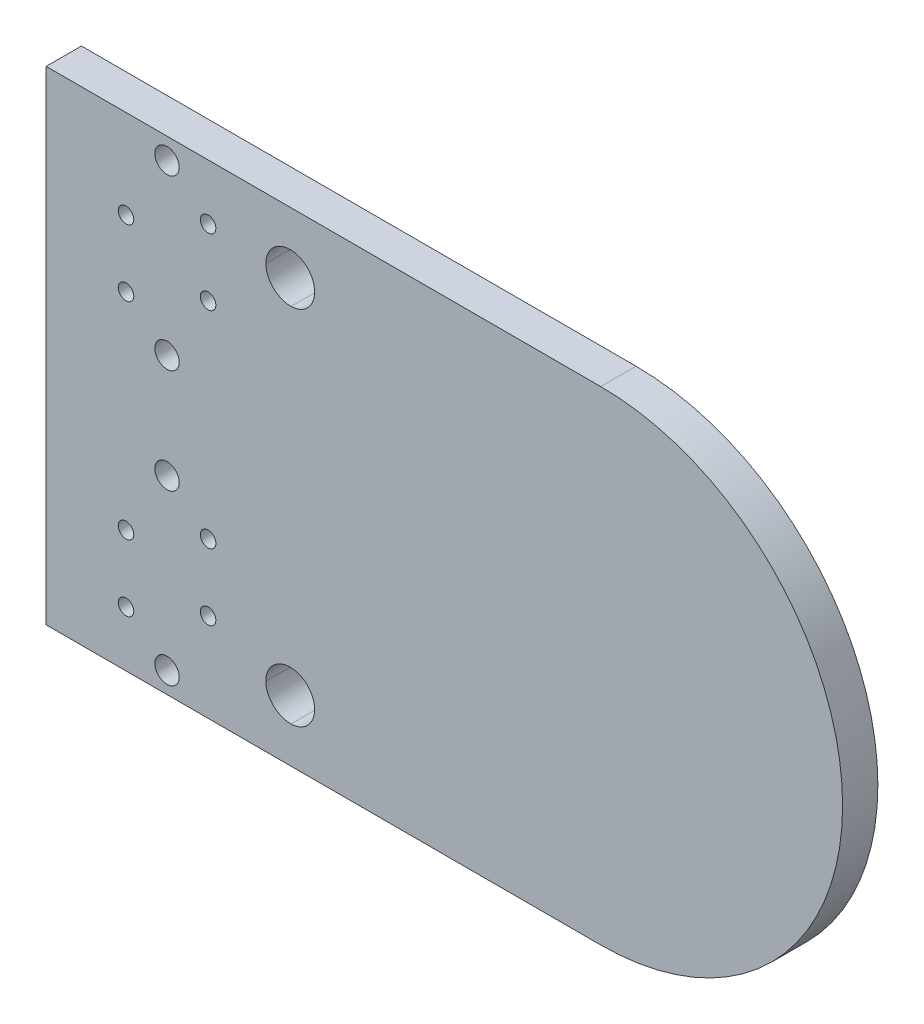
ISO-10303-21;
HEADER;
FILE_DESCRIPTION(('STEP AP214'),'2;1');
FILE_NAME('part.step','',(''),(''),'','','');
FILE_SCHEMA(('AUTOMOTIVE_DESIGN { 1 0 10303 214 1 1 1 1 }'));
ENDSEC;
DATA;
#1=APPLICATION_CONTEXT('core data for automotive mechanical design processes');
#2=APPLICATION_PROTOCOL_DEFINITION('international standard','automotive_design',2000,#1);
#3=PRODUCT_CONTEXT('',#1,'mechanical');
#4=PRODUCT('Part','Part','',(#3));
#5=PRODUCT_RELATED_PRODUCT_CATEGORY('part','',(#4));
#6=PRODUCT_DEFINITION_FORMATION('','',#4);
#7=PRODUCT_DEFINITION_CONTEXT('part definition',#1,'design');
#8=PRODUCT_DEFINITION('design','',#6,#7);
#9=PRODUCT_DEFINITION_SHAPE('','',#8);
#10=(LENGTH_UNIT() NAMED_UNIT(*) SI_UNIT(.MILLI.,.METRE.));
#11=(NAMED_UNIT(*) PLANE_ANGLE_UNIT() SI_UNIT($,.RADIAN.));
#12=(NAMED_UNIT(*) SI_UNIT($,.STERADIAN.) SOLID_ANGLE_UNIT());
#13=UNCERTAINTY_MEASURE_WITH_UNIT(LENGTH_MEASURE(1.E-05),#10,'distance_accuracy_value','');
#14=(GEOMETRIC_REPRESENTATION_CONTEXT(3) GLOBAL_UNCERTAINTY_ASSIGNED_CONTEXT((#13)) GLOBAL_UNIT_ASSIGNED_CONTEXT((#10,
#11,#12)) REPRESENTATION_CONTEXT('',''));
#15=CARTESIAN_POINT('',(0.,0.,0.));
#16=DIRECTION('',(0.,0.,1.));
#17=DIRECTION('',(1.,0.,0.));
#18=AXIS2_PLACEMENT_3D('',#15,#16,#17);
#19=CARTESIAN_POINT('',(48.,90.,0.));
#20=DIRECTION('',(0.,0.,1.));
#21=DIRECTION('',(1.,0.,0.));
#22=AXIS2_PLACEMENT_3D('',#19,#20,#21);
#23=PLANE('',#22);
#24=CARTESIAN_POINT('',(34.0201245726064,98.1708937940572,0.));
#25=DIRECTION('',(0.,0.,1.));
#26=DIRECTION('',(-1.,0.,0.));
#27=AXIS2_PLACEMENT_3D('',#24,#25,#26);
#28=CIRCLE('',#27,1.12022);
#29=CARTESIAN_POINT('',(32.9001,98.14997,0.));
#30=VERTEX_POINT('',#29);
#31=CARTESIAN_POINT('',(34.04109,97.05087,0.));
#32=VERTEX_POINT('',#31);
#33=EDGE_CURVE('E140',#30,#32,#28,.T.);
#34=ORIENTED_EDGE('',*,*,#33,.T.);
#35=CARTESIAN_POINT('',(34.0210286363631,98.1298135103791,0.));
#36=DIRECTION('',(0.,0.,1.));
#37=DIRECTION('',(-1.,0.,0.));
#38=AXIS2_PLACEMENT_3D('',#35,#36,#37);
#39=CIRCLE('',#38,1.07913000000001);
#40=CARTESIAN_POINT('',(35.09997,98.14999,0.));
#41=VERTEX_POINT('',#40);
#42=EDGE_CURVE('E134',#32,#41,#39,.T.);
#43=ORIENTED_EDGE('',*,*,#42,.T.);
#44=CARTESIAN_POINT('',(34.0000500164074,98.1498000164131,0.));
#45=DIRECTION('',(0.,0.,1.));
#46=DIRECTION('',(-1.,0.,0.));
#47=AXIS2_PLACEMENT_3D('',#44,#45,#46);
#48=CIRCLE('',#47,1.09992);
#49=CARTESIAN_POINT('',(33.99986,99.24972,0.));
#50=VERTEX_POINT('',#49);
#51=EDGE_CURVE('E143',#41,#50,#48,.T.);
#52=ORIENTED_EDGE('',*,*,#51,.T.);
#53=CARTESIAN_POINT('',(33.9998299998181,98.1499900004092,0.));
#54=DIRECTION('',(0.,0.,1.));
#55=DIRECTION('',(-1.,0.,0.));
#56=AXIS2_PLACEMENT_3D('',#53,#54,#55);
#57=CIRCLE('',#56,1.09973);
#58=EDGE_CURVE('E58',#50,#30,#57,.T.);
#59=ORIENTED_EDGE('',*,*,#58,.T.);
#60=EDGE_LOOP('',(#34,#43,#52,#59));
#61=FACE_BOUND('',#60,.T.);
#62=CARTESIAN_POINT('',(34.0201245726064,81.8708937940572,0.));
#63=DIRECTION('',(0.,0.,1.));
#64=DIRECTION('',(-1.,0.,0.));
#65=AXIS2_PLACEMENT_3D('',#62,#63,#64);
#66=CIRCLE('',#65,1.12022);
#67=CARTESIAN_POINT('',(32.9001,81.84997,0.));
#68=VERTEX_POINT('',#67);
#69=CARTESIAN_POINT('',(34.04109,80.75087,0.));
#70=VERTEX_POINT('',#69);
#71=EDGE_CURVE('E178',#68,#70,#66,.T.);
#72=ORIENTED_EDGE('',*,*,#71,.T.);
#73=CARTESIAN_POINT('',(34.0210286363631,81.829813510379,0.));
#74=DIRECTION('',(0.,0.,1.));
#75=DIRECTION('',(-1.,0.,0.));
#76=AXIS2_PLACEMENT_3D('',#73,#74,#75);
#77=CIRCLE('',#76,1.07913);
#78=CARTESIAN_POINT('',(35.09997,81.84999,0.));
#79=VERTEX_POINT('',#78);
#80=EDGE_CURVE('E168',#70,#79,#77,.T.);
#81=ORIENTED_EDGE('',*,*,#80,.T.);
#82=CARTESIAN_POINT('',(34.0000500164074,81.8498000164131,0.));
#83=DIRECTION('',(0.,0.,1.));
#84=DIRECTION('',(-1.,0.,0.));
#85=AXIS2_PLACEMENT_3D('',#82,#83,#84);
#86=CIRCLE('',#85,1.09992);
#87=CARTESIAN_POINT('',(33.99986,82.94972,0.));
#88=VERTEX_POINT('',#87);
#89=EDGE_CURVE('E171',#79,#88,#86,.T.);
#90=ORIENTED_EDGE('',*,*,#89,.T.);
#91=CARTESIAN_POINT('',(33.9998299998181,81.8499900004092,0.));
#92=DIRECTION('',(0.,0.,1.));
#93=DIRECTION('',(-1.,0.,0.));
#94=AXIS2_PLACEMENT_3D('',#91,#92,#93);
#95=CIRCLE('',#94,1.09973);
#96=EDGE_CURVE('E175',#88,#68,#95,.T.);
#97=ORIENTED_EDGE('',*,*,#96,.T.);
#98=EDGE_LOOP('',(#72,#81,#90,#97));
#99=FACE_BOUND('',#98,.T.);
#100=CARTESIAN_POINT('',(26.59999,81.6,0.));
#101=DIRECTION('',(0.,0.,-1.));
#102=DIRECTION('',(-1.,0.,0.));
#103=AXIS2_PLACEMENT_3D('',#100,#101,#102);
#104=CIRCLE('',#103,0.349999999999986);
#105=CARTESIAN_POINT('',(26.24999,81.6,0.));
#106=VERTEX_POINT('',#105);
#107=EDGE_CURVE('E193',#106,#106,#104,.T.);
#108=ORIENTED_EDGE('',*,*,#107,.F.);
#109=EDGE_LOOP('',(#108));
#110=FACE_BOUND('',#109,.T.);
#111=CARTESIAN_POINT('',(30.29999,83.1,0.));
#112=DIRECTION('',(0.,0.,-1.));
#113=DIRECTION('',(-1.,0.,0.));
#114=AXIS2_PLACEMENT_3D('',#111,#112,#113);
#115=CIRCLE('',#114,0.349999999999986);
#116=CARTESIAN_POINT('',(29.94999,83.1,0.));
#117=VERTEX_POINT('',#116);
#118=EDGE_CURVE('E205',#117,#117,#115,.T.);
#119=ORIENTED_EDGE('',*,*,#118,.F.);
#120=EDGE_LOOP('',(#119));
#121=FACE_BOUND('',#120,.T.);
#122=CARTESIAN_POINT('',(26.59999,84.6,0.));
#123=DIRECTION('',(0.,0.,-1.));
#124=DIRECTION('',(-1.,0.,0.));
#125=AXIS2_PLACEMENT_3D('',#122,#123,#124);
#126=CIRCLE('',#125,0.349999999999986);
#127=CARTESIAN_POINT('',(26.24999,84.6,0.));
#128=VERTEX_POINT('',#127);
#129=EDGE_CURVE('E211',#128,#128,#126,.T.);
#130=ORIENTED_EDGE('',*,*,#129,.F.);
#131=EDGE_LOOP('',(#130));
#132=FACE_BOUND('',#131,.T.);
#133=CARTESIAN_POINT('',(30.29999,86.1,0.));
#134=DIRECTION('',(0.,0.,-1.));
#135=DIRECTION('',(-1.,0.,0.));
#136=AXIS2_PLACEMENT_3D('',#133,#134,#135);
#137=CIRCLE('',#136,0.349999999999986);
#138=CARTESIAN_POINT('',(29.94999,86.1,0.));
#139=VERTEX_POINT('',#138);
#140=EDGE_CURVE('E217',#139,#139,#137,.T.);
#141=ORIENTED_EDGE('',*,*,#140,.F.);
#142=EDGE_LOOP('',(#141));
#143=FACE_BOUND('',#142,.T.);
#144=CARTESIAN_POINT('',(28.44999,80.05001,0.));
#145=DIRECTION('',(0.,0.,-1.));
#146=DIRECTION('',(-1.,0.,0.));
#147=AXIS2_PLACEMENT_3D('',#144,#145,#146);
#148=CIRCLE('',#147,0.549999999999988);
#149=CARTESIAN_POINT('',(27.89999,80.05001,0.));
#150=VERTEX_POINT('',#149);
#151=EDGE_CURVE('E223',#150,#150,#148,.T.);
#152=ORIENTED_EDGE('',*,*,#151,.F.);
#153=EDGE_LOOP('',(#152));
#154=FACE_BOUND('',#153,.T.);
#155=CARTESIAN_POINT('',(26.59999,93.9,0.));
#156=DIRECTION('',(0.,0.,-1.));
#157=DIRECTION('',(-1.,0.,0.));
#158=AXIS2_PLACEMENT_3D('',#155,#156,#157);
#159=CIRCLE('',#158,0.349999999999986);
#160=CARTESIAN_POINT('',(26.24999,93.9,0.));
#161=VERTEX_POINT('',#160);
#162=EDGE_CURVE('E235',#161,#161,#159,.T.);
#163=ORIENTED_EDGE('',*,*,#162,.F.);
#164=EDGE_LOOP('',(#163));
#165=FACE_BOUND('',#164,.T.);
#166=CARTESIAN_POINT('',(30.29999,95.4,0.));
#167=DIRECTION('',(0.,0.,-1.));
#168=DIRECTION('',(-1.,0.,0.));
#169=AXIS2_PLACEMENT_3D('',#166,#167,#168);
#170=CIRCLE('',#169,0.349999999999986);
#171=CARTESIAN_POINT('',(29.94999,95.4,0.));
#172=VERTEX_POINT('',#171);
#173=EDGE_CURVE('E241',#172,#172,#170,.T.);
#174=ORIENTED_EDGE('',*,*,#173,.F.);
#175=EDGE_LOOP('',(#174));
#176=FACE_BOUND('',#175,.T.);
#177=CARTESIAN_POINT('',(26.59999,96.9,0.));
#178=DIRECTION('',(0.,0.,-1.));
#179=DIRECTION('',(-1.,0.,0.));
#180=AXIS2_PLACEMENT_3D('',#177,#178,#179);
#181=CIRCLE('',#180,0.349999999999986);
#182=CARTESIAN_POINT('',(26.24999,96.9,0.));
#183=VERTEX_POINT('',#182);
#184=EDGE_CURVE('E247',#183,#183,#181,.T.);
#185=ORIENTED_EDGE('',*,*,#184,.F.);
#186=EDGE_LOOP('',(#185));
#187=FACE_BOUND('',#186,.T.);
#188=CARTESIAN_POINT('',(30.29999,98.4,0.));
#189=DIRECTION('',(0.,0.,-1.));
#190=DIRECTION('',(-1.,0.,0.));
#191=AXIS2_PLACEMENT_3D('',#188,#189,#190);
#192=CIRCLE('',#191,0.349999999999986);
#193=CARTESIAN_POINT('',(29.94999,98.4,0.));
#194=VERTEX_POINT('',#193);
#195=EDGE_CURVE('E253',#194,#194,#192,.T.);
#196=ORIENTED_EDGE('',*,*,#195,.F.);
#197=EDGE_LOOP('',(#196));
#198=FACE_BOUND('',#197,.T.);
#199=CARTESIAN_POINT('',(28.44999,92.35001,0.));
#200=DIRECTION('',(0.,0.,-1.));
#201=DIRECTION('',(-1.,0.,0.));
#202=AXIS2_PLACEMENT_3D('',#199,#200,#201);
#203=CIRCLE('',#202,0.549999999999988);
#204=CARTESIAN_POINT('',(27.89999,92.35001,0.));
#205=VERTEX_POINT('',#204);
#206=EDGE_CURVE('E259',#205,#205,#203,.T.);
#207=ORIENTED_EDGE('',*,*,#206,.F.);
#208=EDGE_LOOP('',(#207));
#209=FACE_BOUND('',#208,.T.);
#210=CARTESIAN_POINT('',(28.44999,99.95,0.));
#211=DIRECTION('',(0.,0.,-1.));
#212=DIRECTION('',(-1.,0.,0.));
#213=AXIS2_PLACEMENT_3D('',#210,#211,#212);
#214=CIRCLE('',#213,0.549999999999988);
#215=CARTESIAN_POINT('',(27.89999,99.95,0.));
#216=VERTEX_POINT('',#215);
#217=EDGE_CURVE('E265',#216,#216,#214,.T.);
#218=ORIENTED_EDGE('',*,*,#217,.F.);
#219=EDGE_LOOP('',(#218));
#220=FACE_BOUND('',#219,.T.);
#221=CARTESIAN_POINT('',(48.,90.,0.));
#222=DIRECTION('',(0.,0.,1.));
#223=DIRECTION('',(1.,0.,0.));
#224=AXIS2_PLACEMENT_3D('',#221,#222,#223);
#225=CIRCLE('',#224,10.9);
#226=CARTESIAN_POINT('',(48.,79.1,0.));
#227=VERTEX_POINT('',#226);
#228=CARTESIAN_POINT('',(48.,100.9,0.));
#229=VERTEX_POINT('',#228);
#230=EDGE_CURVE('E271',#227,#229,#225,.T.);
#231=ORIENTED_EDGE('',*,*,#230,.F.);
#232=DIRECTION('',(1.,0.,0.));
#233=VECTOR('',#232,1.);
#234=CARTESIAN_POINT('',(23.,79.1,0.));
#235=LINE('',#234,#233);
#236=CARTESIAN_POINT('',(23.,79.1,0.));
#237=VERTEX_POINT('',#236);
#238=EDGE_CURVE('E276',#237,#227,#235,.T.);
#239=ORIENTED_EDGE('',*,*,#238,.F.);
#240=DIRECTION('',(0.,-1.,0.));
#241=VECTOR('',#240,1.);
#242=CARTESIAN_POINT('',(23.,100.9,0.));
#243=LINE('',#242,#241);
#244=CARTESIAN_POINT('',(23.,100.9,0.));
#245=VERTEX_POINT('',#244);
#246=EDGE_CURVE('E287',#245,#237,#243,.T.);
#247=ORIENTED_EDGE('',*,*,#246,.F.);
#248=DIRECTION('',(-1.,0.,0.));
#249=VECTOR('',#248,1.);
#250=CARTESIAN_POINT('',(48.,100.9,0.));
#251=LINE('',#250,#249);
#252=EDGE_CURVE('E285',#229,#245,#251,.T.);
#253=ORIENTED_EDGE('',*,*,#252,.F.);
#254=EDGE_LOOP('',(#231,#239,#247,#253));
#255=FACE_BOUND('',#254,.T.);
#256=CARTESIAN_POINT('',(28.44999,87.65,0.));
#257=DIRECTION('',(0.,0.,-1.));
#258=DIRECTION('',(-1.,0.,0.));
#259=AXIS2_PLACEMENT_3D('',#256,#257,#258);
#260=CIRCLE('',#259,0.549999999999988);
#261=CARTESIAN_POINT('',(27.89999,87.65,0.));
#262=VERTEX_POINT('',#261);
#263=EDGE_CURVE('E229',#262,#262,#260,.T.);
#264=ORIENTED_EDGE('',*,*,#263,.F.);
#265=EDGE_LOOP('',(#264));
#266=FACE_BOUND('',#265,.T.);
#267=ADVANCED_FACE('F43',(#61,#99,#110,#121,#132,#143,#154,#165,#176,#187,#198,#209,#220,#255,
#266),#23,.F.);
#268=CARTESIAN_POINT('',(48.,90.,1.59));
#269=DIRECTION('',(0.,0.,-1.));
#270=DIRECTION('',(-1.,0.,0.));
#271=AXIS2_PLACEMENT_3D('',#268,#269,#270);
#272=CYLINDRICAL_SURFACE('',#271,10.9);
#273=ORIENTED_EDGE('',*,*,#230,.T.);
#274=DIRECTION('',(0.,0.,-1.));
#275=VECTOR('',#274,1.);
#276=CARTESIAN_POINT('',(48.,100.9,1.59));
#277=LINE('',#276,#275);
#278=CARTESIAN_POINT('',(48.,100.9,1.59));
#279=VERTEX_POINT('',#278);
#280=EDGE_CURVE('E11',#279,#229,#277,.T.);
#281=ORIENTED_EDGE('',*,*,#280,.F.);
#282=CARTESIAN_POINT('',(48.,90.,1.59));
#283=DIRECTION('',(0.,0.,1.));
#284=DIRECTION('',(1.,0.,0.));
#285=AXIS2_PLACEMENT_3D('',#282,#283,#284);
#286=CIRCLE('',#285,10.9);
#287=CARTESIAN_POINT('',(48.,79.1,1.59));
#288=VERTEX_POINT('',#287);
#289=EDGE_CURVE('E272',#288,#279,#286,.T.);
#290=ORIENTED_EDGE('',*,*,#289,.F.);
#291=DIRECTION('',(0.,0.,-1.));
#292=VECTOR('',#291,1.);
#293=CARTESIAN_POINT('',(48.,79.1,1.59));
#294=LINE('',#293,#292);
#295=EDGE_CURVE('E282',#288,#227,#294,.T.);
#296=ORIENTED_EDGE('',*,*,#295,.T.);
#297=EDGE_LOOP('',(#273,#281,#290,#296));
#298=FACE_BOUND('',#297,.T.);
#299=ADVANCED_FACE('F45',(#298),#272,.T.);
#300=CARTESIAN_POINT('',(48.,100.9,1.59));
#301=DIRECTION('',(0.,-1.,0.));
#302=DIRECTION('',(0.,0.,-1.));
#303=AXIS2_PLACEMENT_3D('',#300,#301,#302);
#304=PLANE('',#303);
#305=ORIENTED_EDGE('',*,*,#252,.T.);
#306=DIRECTION('',(0.,0.,-1.));
#307=VECTOR('',#306,1.);
#308=CARTESIAN_POINT('',(23.,100.9,1.59));
#309=LINE('',#308,#307);
#310=CARTESIAN_POINT('',(23.,100.9,1.59));
#311=VERTEX_POINT('',#310);
#312=EDGE_CURVE('E51',#311,#245,#309,.T.);
#313=ORIENTED_EDGE('',*,*,#312,.F.);
#314=DIRECTION('',(-1.,0.,0.));
#315=VECTOR('',#314,1.);
#316=CARTESIAN_POINT('',(48.,100.9,1.59));
#317=LINE('',#316,#315);
#318=EDGE_CURVE('E275',#279,#311,#317,.T.);
#319=ORIENTED_EDGE('',*,*,#318,.F.);
#320=ORIENTED_EDGE('',*,*,#280,.T.);
#321=EDGE_LOOP('',(#305,#313,#319,#320));
#322=FACE_BOUND('',#321,.T.);
#323=ADVANCED_FACE('F315',(#322),#304,.F.);
#324=CARTESIAN_POINT('',(23.,100.9,1.59));
#325=DIRECTION('',(1.,0.,0.));
#326=DIRECTION('',(0.,0.,-1.));
#327=AXIS2_PLACEMENT_3D('',#324,#325,#326);
#328=PLANE('',#327);
#329=ORIENTED_EDGE('',*,*,#246,.T.);
#330=DIRECTION('',(0.,0.,-1.));
#331=VECTOR('',#330,1.);
#332=CARTESIAN_POINT('',(23.,79.1,1.59));
#333=LINE('',#332,#331);
#334=CARTESIAN_POINT('',(23.,79.1,1.59));
#335=VERTEX_POINT('',#334);
#336=EDGE_CURVE('E292',#335,#237,#333,.T.);
#337=ORIENTED_EDGE('',*,*,#336,.F.);
#338=DIRECTION('',(0.,-1.,0.));
#339=VECTOR('',#338,1.);
#340=CARTESIAN_POINT('',(23.,100.9,1.59));
#341=LINE('',#340,#339);
#342=EDGE_CURVE('E278',#311,#335,#341,.T.);
#343=ORIENTED_EDGE('',*,*,#342,.F.);
#344=ORIENTED_EDGE('',*,*,#312,.T.);
#345=EDGE_LOOP('',(#329,#337,#343,#344));
#346=FACE_BOUND('',#345,.T.);
#347=ADVANCED_FACE('F299',(#346),#328,.F.);
#348=CARTESIAN_POINT('',(23.,79.1,1.59));
#349=DIRECTION('',(0.,1.,0.));
#350=DIRECTION('',(0.,0.,1.));
#351=AXIS2_PLACEMENT_3D('',#348,#349,#350);
#352=PLANE('',#351);
#353=ORIENTED_EDGE('',*,*,#238,.T.);
#354=ORIENTED_EDGE('',*,*,#295,.F.);
#355=DIRECTION('',(1.,0.,0.));
#356=VECTOR('',#355,1.);
#357=CARTESIAN_POINT('',(23.,79.1,1.59));
#358=LINE('',#357,#356);
#359=EDGE_CURVE('E280',#335,#288,#358,.T.);
#360=ORIENTED_EDGE('',*,*,#359,.F.);
#361=ORIENTED_EDGE('',*,*,#336,.T.);
#362=EDGE_LOOP('',(#353,#354,#360,#361));
#363=FACE_BOUND('',#362,.T.);
#364=ADVANCED_FACE('F308',(#363),#352,.F.);
#365=CARTESIAN_POINT('',(48.,90.,1.59));
#366=DIRECTION('',(0.,0.,1.));
#367=DIRECTION('',(1.,0.,0.));
#368=AXIS2_PLACEMENT_3D('',#365,#366,#367);
#369=PLANE('',#368);
#370=CARTESIAN_POINT('',(34.0210286363631,98.1298135103791,1.59));
#371=DIRECTION('',(0.,0.,1.));
#372=DIRECTION('',(-1.,0.,0.));
#373=AXIS2_PLACEMENT_3D('',#370,#371,#372);
#374=CIRCLE('',#373,1.07913000000001);
#375=CARTESIAN_POINT('',(34.04109,97.05087,1.59));
#376=VERTEX_POINT('',#375);
#377=CARTESIAN_POINT('',(35.09997,98.14999,1.59));
#378=VERTEX_POINT('',#377);
#379=EDGE_CURVE('E66',#376,#378,#374,.T.);
#380=ORIENTED_EDGE('',*,*,#379,.F.);
#381=CARTESIAN_POINT('',(34.0201245726064,98.1708937940572,1.59));
#382=DIRECTION('',(0.,0.,1.));
#383=DIRECTION('',(-1.,0.,0.));
#384=AXIS2_PLACEMENT_3D('',#381,#382,#383);
#385=CIRCLE('',#384,1.12022);
#386=CARTESIAN_POINT('',(32.9001,98.14997,1.59));
#387=VERTEX_POINT('',#386);
#388=EDGE_CURVE('E149',#387,#376,#385,.T.);
#389=ORIENTED_EDGE('',*,*,#388,.F.);
#390=CARTESIAN_POINT('',(33.9998299998181,98.1499900004092,1.59));
#391=DIRECTION('',(0.,0.,1.));
#392=DIRECTION('',(-1.,0.,0.));
#393=AXIS2_PLACEMENT_3D('',#390,#391,#392);
#394=CIRCLE('',#393,1.09973);
#395=CARTESIAN_POINT('',(33.99986,99.24972,1.59));
#396=VERTEX_POINT('',#395);
#397=EDGE_CURVE('E152',#396,#387,#394,.T.);
#398=ORIENTED_EDGE('',*,*,#397,.F.);
#399=CARTESIAN_POINT('',(34.0000500164074,98.1498000164131,1.59));
#400=DIRECTION('',(0.,0.,1.));
#401=DIRECTION('',(-1.,0.,0.));
#402=AXIS2_PLACEMENT_3D('',#399,#400,#401);
#403=CIRCLE('',#402,1.09992);
#404=EDGE_CURVE('E158',#378,#396,#403,.T.);
#405=ORIENTED_EDGE('',*,*,#404,.F.);
#406=EDGE_LOOP('',(#380,#389,#398,#405));
#407=FACE_BOUND('',#406,.T.);
#408=CARTESIAN_POINT('',(34.0210286363631,81.829813510379,1.59));
#409=DIRECTION('',(0.,0.,1.));
#410=DIRECTION('',(-1.,0.,0.));
#411=AXIS2_PLACEMENT_3D('',#408,#409,#410);
#412=CIRCLE('',#411,1.07913);
#413=CARTESIAN_POINT('',(34.04109,80.75087,1.59));
#414=VERTEX_POINT('',#413);
#415=CARTESIAN_POINT('',(35.09997,81.84999,1.59));
#416=VERTEX_POINT('',#415);
#417=EDGE_CURVE('E164',#414,#416,#412,.T.);
#418=ORIENTED_EDGE('',*,*,#417,.F.);
#419=CARTESIAN_POINT('',(34.0201245726064,81.8708937940572,1.59));
#420=DIRECTION('',(0.,0.,1.));
#421=DIRECTION('',(-1.,0.,0.));
#422=AXIS2_PLACEMENT_3D('',#419,#420,#421);
#423=CIRCLE('',#422,1.12022);
#424=CARTESIAN_POINT('',(32.9001,81.84997,1.59));
#425=VERTEX_POINT('',#424);
#426=EDGE_CURVE('E172',#425,#414,#423,.T.);
#427=ORIENTED_EDGE('',*,*,#426,.F.);
#428=CARTESIAN_POINT('',(33.9998299998181,81.8499900004092,1.59));
#429=DIRECTION('',(0.,0.,1.));
#430=DIRECTION('',(-1.,0.,0.));
#431=AXIS2_PLACEMENT_3D('',#428,#429,#430);
#432=CIRCLE('',#431,1.09973);
#433=CARTESIAN_POINT('',(33.99986,82.94972,1.59));
#434=VERTEX_POINT('',#433);
#435=EDGE_CURVE('E186',#434,#425,#432,.T.);
#436=ORIENTED_EDGE('',*,*,#435,.F.);
#437=CARTESIAN_POINT('',(34.0000500164074,81.8498000164131,1.59));
#438=DIRECTION('',(0.,0.,1.));
#439=DIRECTION('',(-1.,0.,0.));
#440=AXIS2_PLACEMENT_3D('',#437,#438,#439);
#441=CIRCLE('',#440,1.09992);
#442=EDGE_CURVE('E183',#416,#434,#441,.T.);
#443=ORIENTED_EDGE('',*,*,#442,.F.);
#444=EDGE_LOOP('',(#418,#427,#436,#443));
#445=FACE_BOUND('',#444,.T.);
#446=CARTESIAN_POINT('',(26.59999,81.6,1.58999999999999));
#447=DIRECTION('',(0.,0.,-1.));
#448=DIRECTION('',(-1.,0.,0.));
#449=AXIS2_PLACEMENT_3D('',#446,#447,#448);
#450=CIRCLE('',#449,0.349999999999986);
#451=CARTESIAN_POINT('',(26.24999,81.6,1.58999999999999));
#452=VERTEX_POINT('',#451);
#453=EDGE_CURVE('E202',#452,#452,#450,.T.);
#454=ORIENTED_EDGE('',*,*,#453,.T.);
#455=EDGE_LOOP('',(#454));
#456=FACE_BOUND('',#455,.T.);
#457=CARTESIAN_POINT('',(30.29999,83.1,1.58999999999999));
#458=DIRECTION('',(0.,0.,-1.));
#459=DIRECTION('',(-1.,0.,0.));
#460=AXIS2_PLACEMENT_3D('',#457,#458,#459);
#461=CIRCLE('',#460,0.349999999999986);
#462=CARTESIAN_POINT('',(29.94999,83.1,1.58999999999999));
#463=VERTEX_POINT('',#462);
#464=EDGE_CURVE('E208',#463,#463,#461,.T.);
#465=ORIENTED_EDGE('',*,*,#464,.T.);
#466=EDGE_LOOP('',(#465));
#467=FACE_BOUND('',#466,.T.);
#468=CARTESIAN_POINT('',(26.59999,84.6,1.58999999999999));
#469=DIRECTION('',(0.,0.,-1.));
#470=DIRECTION('',(-1.,0.,0.));
#471=AXIS2_PLACEMENT_3D('',#468,#469,#470);
#472=CIRCLE('',#471,0.349999999999986);
#473=CARTESIAN_POINT('',(26.24999,84.6,1.58999999999999));
#474=VERTEX_POINT('',#473);
#475=EDGE_CURVE('E214',#474,#474,#472,.T.);
#476=ORIENTED_EDGE('',*,*,#475,.T.);
#477=EDGE_LOOP('',(#476));
#478=FACE_BOUND('',#477,.T.);
#479=CARTESIAN_POINT('',(30.29999,86.1,1.58999999999999));
#480=DIRECTION('',(0.,0.,-1.));
#481=DIRECTION('',(-1.,0.,0.));
#482=AXIS2_PLACEMENT_3D('',#479,#480,#481);
#483=CIRCLE('',#482,0.349999999999986);
#484=CARTESIAN_POINT('',(29.94999,86.1,1.58999999999999));
#485=VERTEX_POINT('',#484);
#486=EDGE_CURVE('E220',#485,#485,#483,.T.);
#487=ORIENTED_EDGE('',*,*,#486,.T.);
#488=EDGE_LOOP('',(#487));
#489=FACE_BOUND('',#488,.T.);
#490=CARTESIAN_POINT('',(28.44999,80.05001,1.58999999999999));
#491=DIRECTION('',(0.,0.,-1.));
#492=DIRECTION('',(-1.,0.,0.));
#493=AXIS2_PLACEMENT_3D('',#490,#491,#492);
#494=CIRCLE('',#493,0.549999999999988);
#495=CARTESIAN_POINT('',(27.89999,80.05001,1.58999999999999));
#496=VERTEX_POINT('',#495);
#497=EDGE_CURVE('E226',#496,#496,#494,.T.);
#498=ORIENTED_EDGE('',*,*,#497,.T.);
#499=EDGE_LOOP('',(#498));
#500=FACE_BOUND('',#499,.T.);
#501=CARTESIAN_POINT('',(28.44999,87.65,1.58999999999999));
#502=DIRECTION('',(0.,0.,-1.));
#503=DIRECTION('',(-1.,0.,0.));
#504=AXIS2_PLACEMENT_3D('',#501,#502,#503);
#505=CIRCLE('',#504,0.549999999999988);
#506=CARTESIAN_POINT('',(27.89999,87.65,1.58999999999999));
#507=VERTEX_POINT('',#506);
#508=EDGE_CURVE('E232',#507,#507,#505,.T.);
#509=ORIENTED_EDGE('',*,*,#508,.T.);
#510=EDGE_LOOP('',(#509));
#511=FACE_BOUND('',#510,.T.);
#512=CARTESIAN_POINT('',(26.59999,93.9,1.58999999999999));
#513=DIRECTION('',(0.,0.,-1.));
#514=DIRECTION('',(-1.,0.,0.));
#515=AXIS2_PLACEMENT_3D('',#512,#513,#514);
#516=CIRCLE('',#515,0.349999999999986);
#517=CARTESIAN_POINT('',(26.24999,93.9,1.58999999999999));
#518=VERTEX_POINT('',#517);
#519=EDGE_CURVE('E238',#518,#518,#516,.T.);
#520=ORIENTED_EDGE('',*,*,#519,.T.);
#521=EDGE_LOOP('',(#520));
#522=FACE_BOUND('',#521,.T.);
#523=CARTESIAN_POINT('',(30.29999,95.4,1.58999999999999));
#524=DIRECTION('',(0.,0.,-1.));
#525=DIRECTION('',(-1.,0.,0.));
#526=AXIS2_PLACEMENT_3D('',#523,#524,#525);
#527=CIRCLE('',#526,0.349999999999986);
#528=CARTESIAN_POINT('',(29.94999,95.4,1.58999999999999));
#529=VERTEX_POINT('',#528);
#530=EDGE_CURVE('E244',#529,#529,#527,.T.);
#531=ORIENTED_EDGE('',*,*,#530,.T.);
#532=EDGE_LOOP('',(#531));
#533=FACE_BOUND('',#532,.T.);
#534=CARTESIAN_POINT('',(26.59999,96.9,1.58999999999999));
#535=DIRECTION('',(0.,0.,-1.));
#536=DIRECTION('',(-1.,0.,0.));
#537=AXIS2_PLACEMENT_3D('',#534,#535,#536);
#538=CIRCLE('',#537,0.349999999999986);
#539=CARTESIAN_POINT('',(26.24999,96.9,1.58999999999999));
#540=VERTEX_POINT('',#539);
#541=EDGE_CURVE('E250',#540,#540,#538,.T.);
#542=ORIENTED_EDGE('',*,*,#541,.T.);
#543=EDGE_LOOP('',(#542));
#544=FACE_BOUND('',#543,.T.);
#545=CARTESIAN_POINT('',(30.29999,98.4,1.58999999999999));
#546=DIRECTION('',(0.,0.,-1.));
#547=DIRECTION('',(-1.,0.,0.));
#548=AXIS2_PLACEMENT_3D('',#545,#546,#547);
#549=CIRCLE('',#548,0.349999999999986);
#550=CARTESIAN_POINT('',(29.94999,98.4,1.58999999999999));
#551=VERTEX_POINT('',#550);
#552=EDGE_CURVE('E256',#551,#551,#549,.T.);
#553=ORIENTED_EDGE('',*,*,#552,.T.);
#554=EDGE_LOOP('',(#553));
#555=FACE_BOUND('',#554,.T.);
#556=CARTESIAN_POINT('',(28.44999,92.35001,1.58999999999999));
#557=DIRECTION('',(0.,0.,-1.));
#558=DIRECTION('',(-1.,0.,0.));
#559=AXIS2_PLACEMENT_3D('',#556,#557,#558);
#560=CIRCLE('',#559,0.549999999999988);
#561=CARTESIAN_POINT('',(27.89999,92.35001,1.58999999999999));
#562=VERTEX_POINT('',#561);
#563=EDGE_CURVE('E262',#562,#562,#560,.T.);
#564=ORIENTED_EDGE('',*,*,#563,.T.);
#565=EDGE_LOOP('',(#564));
#566=FACE_BOUND('',#565,.T.);
#567=CARTESIAN_POINT('',(28.44999,99.95,1.58999999999999));
#568=DIRECTION('',(0.,0.,-1.));
#569=DIRECTION('',(-1.,0.,0.));
#570=AXIS2_PLACEMENT_3D('',#567,#568,#569);
#571=CIRCLE('',#570,0.549999999999988);
#572=CARTESIAN_POINT('',(27.89999,99.95,1.58999999999999));
#573=VERTEX_POINT('',#572);
#574=EDGE_CURVE('E268',#573,#573,#571,.T.);
#575=ORIENTED_EDGE('',*,*,#574,.T.);
#576=EDGE_LOOP('',(#575));
#577=FACE_BOUND('',#576,.T.);
#578=ORIENTED_EDGE('',*,*,#289,.T.);
#579=ORIENTED_EDGE('',*,*,#318,.T.);
#580=ORIENTED_EDGE('',*,*,#342,.T.);
#581=ORIENTED_EDGE('',*,*,#359,.T.);
#582=EDGE_LOOP('',(#578,#579,#580,#581));
#583=FACE_BOUND('',#582,.T.);
#584=ADVANCED_FACE('F314',(#407,#445,#456,#467,#478,#489,#500,#511,#522,#533,#544,#555,#566,
#577,#583),#369,.T.);
#585=CARTESIAN_POINT('',(28.44999,99.95,0.));
#586=DIRECTION('',(0.,0.,-1.));
#587=DIRECTION('',(-1.,0.,0.));
#588=AXIS2_PLACEMENT_3D('',#585,#586,#587);
#589=CYLINDRICAL_SURFACE('',#588,0.549999999999988);
#590=ORIENTED_EDGE('',*,*,#574,.F.);
#591=EDGE_LOOP('',(#590));
#592=FACE_BOUND('',#591,.T.);
#593=ORIENTED_EDGE('',*,*,#217,.T.);
#594=EDGE_LOOP('',(#593));
#595=FACE_BOUND('',#594,.T.);
#596=ADVANCED_FACE('F333',(#592,#595),#589,.F.);
#597=CARTESIAN_POINT('',(28.44999,92.35001,0.));
#598=DIRECTION('',(0.,0.,-1.));
#599=DIRECTION('',(-1.,0.,0.));
#600=AXIS2_PLACEMENT_3D('',#597,#598,#599);
#601=CYLINDRICAL_SURFACE('',#600,0.549999999999988);
#602=ORIENTED_EDGE('',*,*,#563,.F.);
#603=EDGE_LOOP('',(#602));
#604=FACE_BOUND('',#603,.T.);
#605=ORIENTED_EDGE('',*,*,#206,.T.);
#606=EDGE_LOOP('',(#605));
#607=FACE_BOUND('',#606,.T.);
#608=ADVANCED_FACE('F338',(#604,#607),#601,.F.);
#609=CARTESIAN_POINT('',(30.29999,98.4,0.));
#610=DIRECTION('',(0.,0.,-1.));
#611=DIRECTION('',(-1.,0.,0.));
#612=AXIS2_PLACEMENT_3D('',#609,#610,#611);
#613=CYLINDRICAL_SURFACE('',#612,0.349999999999986);
#614=ORIENTED_EDGE('',*,*,#552,.F.);
#615=EDGE_LOOP('',(#614));
#616=FACE_BOUND('',#615,.T.);
#617=ORIENTED_EDGE('',*,*,#195,.T.);
#618=EDGE_LOOP('',(#617));
#619=FACE_BOUND('',#618,.T.);
#620=ADVANCED_FACE('F375',(#616,#619),#613,.F.);
#621=CARTESIAN_POINT('',(26.59999,96.9,0.));
#622=DIRECTION('',(0.,0.,-1.));
#623=DIRECTION('',(-1.,0.,0.));
#624=AXIS2_PLACEMENT_3D('',#621,#622,#623);
#625=CYLINDRICAL_SURFACE('',#624,0.349999999999986);
#626=ORIENTED_EDGE('',*,*,#541,.F.);
#627=EDGE_LOOP('',(#626));
#628=FACE_BOUND('',#627,.T.);
#629=ORIENTED_EDGE('',*,*,#184,.T.);
#630=EDGE_LOOP('',(#629));
#631=FACE_BOUND('',#630,.T.);
#632=ADVANCED_FACE('F382',(#628,#631),#625,.F.);
#633=CARTESIAN_POINT('',(30.29999,95.4,0.));
#634=DIRECTION('',(0.,0.,-1.));
#635=DIRECTION('',(-1.,0.,0.));
#636=AXIS2_PLACEMENT_3D('',#633,#634,#635);
#637=CYLINDRICAL_SURFACE('',#636,0.349999999999986);
#638=ORIENTED_EDGE('',*,*,#530,.F.);
#639=EDGE_LOOP('',(#638));
#640=FACE_BOUND('',#639,.T.);
#641=ORIENTED_EDGE('',*,*,#173,.T.);
#642=EDGE_LOOP('',(#641));
#643=FACE_BOUND('',#642,.T.);
#644=ADVANCED_FACE('F388',(#640,#643),#637,.F.);
#645=CARTESIAN_POINT('',(26.59999,93.9,0.));
#646=DIRECTION('',(0.,0.,-1.));
#647=DIRECTION('',(-1.,0.,0.));
#648=AXIS2_PLACEMENT_3D('',#645,#646,#647);
#649=CYLINDRICAL_SURFACE('',#648,0.349999999999986);
#650=ORIENTED_EDGE('',*,*,#519,.F.);
#651=EDGE_LOOP('',(#650));
#652=FACE_BOUND('',#651,.T.);
#653=ORIENTED_EDGE('',*,*,#162,.T.);
#654=EDGE_LOOP('',(#653));
#655=FACE_BOUND('',#654,.T.);
#656=ADVANCED_FACE('F392',(#652,#655),#649,.F.);
#657=CARTESIAN_POINT('',(28.44999,87.65,0.));
#658=DIRECTION('',(0.,0.,-1.));
#659=DIRECTION('',(-1.,0.,0.));
#660=AXIS2_PLACEMENT_3D('',#657,#658,#659);
#661=CYLINDRICAL_SURFACE('',#660,0.549999999999988);
#662=ORIENTED_EDGE('',*,*,#508,.F.);
#663=EDGE_LOOP('',(#662));
#664=FACE_BOUND('',#663,.T.);
#665=ORIENTED_EDGE('',*,*,#263,.T.);
#666=EDGE_LOOP('',(#665));
#667=FACE_BOUND('',#666,.T.);
#668=ADVANCED_FACE('F396',(#664,#667),#661,.F.);
#669=CARTESIAN_POINT('',(28.44999,80.05001,0.));
#670=DIRECTION('',(0.,0.,-1.));
#671=DIRECTION('',(-1.,0.,0.));
#672=AXIS2_PLACEMENT_3D('',#669,#670,#671);
#673=CYLINDRICAL_SURFACE('',#672,0.549999999999988);
#674=ORIENTED_EDGE('',*,*,#497,.F.);
#675=EDGE_LOOP('',(#674));
#676=FACE_BOUND('',#675,.T.);
#677=ORIENTED_EDGE('',*,*,#151,.T.);
#678=EDGE_LOOP('',(#677));
#679=FACE_BOUND('',#678,.T.);
#680=ADVANCED_FACE('F400',(#676,#679),#673,.F.);
#681=CARTESIAN_POINT('',(30.29999,86.1,0.));
#682=DIRECTION('',(0.,0.,-1.));
#683=DIRECTION('',(-1.,0.,0.));
#684=AXIS2_PLACEMENT_3D('',#681,#682,#683);
#685=CYLINDRICAL_SURFACE('',#684,0.349999999999986);
#686=ORIENTED_EDGE('',*,*,#486,.F.);
#687=EDGE_LOOP('',(#686));
#688=FACE_BOUND('',#687,.T.);
#689=ORIENTED_EDGE('',*,*,#140,.T.);
#690=EDGE_LOOP('',(#689));
#691=FACE_BOUND('',#690,.T.);
#692=ADVANCED_FACE('F404',(#688,#691),#685,.F.);
#693=CARTESIAN_POINT('',(26.59999,84.6,0.));
#694=DIRECTION('',(0.,0.,-1.));
#695=DIRECTION('',(-1.,0.,0.));
#696=AXIS2_PLACEMENT_3D('',#693,#694,#695);
#697=CYLINDRICAL_SURFACE('',#696,0.349999999999986);
#698=ORIENTED_EDGE('',*,*,#475,.F.);
#699=EDGE_LOOP('',(#698));
#700=FACE_BOUND('',#699,.T.);
#701=ORIENTED_EDGE('',*,*,#129,.T.);
#702=EDGE_LOOP('',(#701));
#703=FACE_BOUND('',#702,.T.);
#704=ADVANCED_FACE('F408',(#700,#703),#697,.F.);
#705=CARTESIAN_POINT('',(30.29999,83.1,0.));
#706=DIRECTION('',(0.,0.,-1.));
#707=DIRECTION('',(-1.,0.,0.));
#708=AXIS2_PLACEMENT_3D('',#705,#706,#707);
#709=CYLINDRICAL_SURFACE('',#708,0.349999999999986);
#710=ORIENTED_EDGE('',*,*,#464,.F.);
#711=EDGE_LOOP('',(#710));
#712=FACE_BOUND('',#711,.T.);
#713=ORIENTED_EDGE('',*,*,#118,.T.);
#714=EDGE_LOOP('',(#713));
#715=FACE_BOUND('',#714,.T.);
#716=ADVANCED_FACE('F412',(#712,#715),#709,.F.);
#717=CARTESIAN_POINT('',(26.59999,81.6,0.));
#718=DIRECTION('',(0.,0.,-1.));
#719=DIRECTION('',(-1.,0.,0.));
#720=AXIS2_PLACEMENT_3D('',#717,#718,#719);
#721=CYLINDRICAL_SURFACE('',#720,0.349999999999986);
#722=ORIENTED_EDGE('',*,*,#453,.F.);
#723=EDGE_LOOP('',(#722));
#724=FACE_BOUND('',#723,.T.);
#725=ORIENTED_EDGE('',*,*,#107,.T.);
#726=EDGE_LOOP('',(#725));
#727=FACE_BOUND('',#726,.T.);
#728=ADVANCED_FACE('F416',(#724,#727),#721,.F.);
#729=CARTESIAN_POINT('',(34.0210286363631,81.829813510379,0.));
#730=DIRECTION('',(0.,0.,1.));
#731=DIRECTION('',(1.,0.,0.));
#732=AXIS2_PLACEMENT_3D('',#729,#730,#731);
#733=CYLINDRICAL_SURFACE('',#732,1.07913);
#734=ORIENTED_EDGE('',*,*,#417,.T.);
#735=DIRECTION('',(0.,0.,1.));
#736=VECTOR('',#735,1.);
#737=CARTESIAN_POINT('',(35.09997,81.84999,0.));
#738=LINE('',#737,#736);
#739=EDGE_CURVE('E181',#79,#416,#738,.T.);
#740=ORIENTED_EDGE('',*,*,#739,.F.);
#741=ORIENTED_EDGE('',*,*,#80,.F.);
#742=DIRECTION('',(0.,0.,1.));
#743=VECTOR('',#742,1.);
#744=CARTESIAN_POINT('',(34.04109,80.75087,0.));
#745=LINE('',#744,#743);
#746=EDGE_CURVE('E191',#70,#414,#745,.T.);
#747=ORIENTED_EDGE('',*,*,#746,.T.);
#748=EDGE_LOOP('',(#734,#740,#741,#747));
#749=FACE_BOUND('',#748,.T.);
#750=ADVANCED_FACE('F420',(#749),#733,.F.);
#751=CARTESIAN_POINT('',(34.0201245726064,81.8708937940572,0.));
#752=DIRECTION('',(0.,0.,1.));
#753=DIRECTION('',(1.,0.,0.));
#754=AXIS2_PLACEMENT_3D('',#751,#752,#753);
#755=CYLINDRICAL_SURFACE('',#754,1.12022);
#756=ORIENTED_EDGE('',*,*,#426,.T.);
#757=ORIENTED_EDGE('',*,*,#746,.F.);
#758=ORIENTED_EDGE('',*,*,#71,.F.);
#759=DIRECTION('',(0.,0.,1.));
#760=VECTOR('',#759,1.);
#761=CARTESIAN_POINT('',(32.9001,81.84997,0.));
#762=LINE('',#761,#760);
#763=EDGE_CURVE('E194',#68,#425,#762,.T.);
#764=ORIENTED_EDGE('',*,*,#763,.T.);
#765=EDGE_LOOP('',(#756,#757,#758,#764));
#766=FACE_BOUND('',#765,.T.);
#767=ADVANCED_FACE('F424',(#766),#755,.F.);
#768=CARTESIAN_POINT('',(33.9998299998181,81.8499900004092,0.));
#769=DIRECTION('',(0.,0.,1.));
#770=DIRECTION('',(1.,0.,0.));
#771=AXIS2_PLACEMENT_3D('',#768,#769,#770);
#772=CYLINDRICAL_SURFACE('',#771,1.09973);
#773=ORIENTED_EDGE('',*,*,#435,.T.);
#774=ORIENTED_EDGE('',*,*,#763,.F.);
#775=ORIENTED_EDGE('',*,*,#96,.F.);
#776=DIRECTION('',(0.,0.,1.));
#777=VECTOR('',#776,1.);
#778=CARTESIAN_POINT('',(33.99986,82.94972,0.));
#779=LINE('',#778,#777);
#780=EDGE_CURVE('E196',#88,#434,#779,.T.);
#781=ORIENTED_EDGE('',*,*,#780,.T.);
#782=EDGE_LOOP('',(#773,#774,#775,#781));
#783=FACE_BOUND('',#782,.T.);
#784=ADVANCED_FACE('F429',(#783),#772,.F.);
#785=CARTESIAN_POINT('',(34.0000500164074,81.8498000164131,0.));
#786=DIRECTION('',(0.,0.,1.));
#787=DIRECTION('',(1.,0.,0.));
#788=AXIS2_PLACEMENT_3D('',#785,#786,#787);
#789=CYLINDRICAL_SURFACE('',#788,1.09992);
#790=ORIENTED_EDGE('',*,*,#442,.T.);
#791=ORIENTED_EDGE('',*,*,#780,.F.);
#792=ORIENTED_EDGE('',*,*,#89,.F.);
#793=ORIENTED_EDGE('',*,*,#739,.T.);
#794=EDGE_LOOP('',(#790,#791,#792,#793));
#795=FACE_BOUND('',#794,.T.);
#796=ADVANCED_FACE('F426',(#795),#789,.F.);
#797=CARTESIAN_POINT('',(34.0210286363631,98.1298135103791,0.));
#798=DIRECTION('',(0.,0.,1.));
#799=DIRECTION('',(1.,0.,0.));
#800=AXIS2_PLACEMENT_3D('',#797,#798,#799);
#801=CYLINDRICAL_SURFACE('',#800,1.07913000000001);
#802=ORIENTED_EDGE('',*,*,#379,.T.);
#803=DIRECTION('',(0.,0.,1.));
#804=VECTOR('',#803,1.);
#805=CARTESIAN_POINT('',(35.09997,98.14999,0.));
#806=LINE('',#805,#804);
#807=EDGE_CURVE('E130',#41,#378,#806,.T.);
#808=ORIENTED_EDGE('',*,*,#807,.F.);
#809=ORIENTED_EDGE('',*,*,#42,.F.);
#810=DIRECTION('',(0.,0.,1.));
#811=VECTOR('',#810,1.);
#812=CARTESIAN_POINT('',(34.04109,97.05087,0.));
#813=LINE('',#812,#811);
#814=EDGE_CURVE('E162',#32,#376,#813,.T.);
#815=ORIENTED_EDGE('',*,*,#814,.T.);
#816=EDGE_LOOP('',(#802,#808,#809,#815));
#817=FACE_BOUND('',#816,.T.);
#818=ADVANCED_FACE('F132',(#817),#801,.F.);
#819=CARTESIAN_POINT('',(34.0201245726064,98.1708937940572,0.));
#820=DIRECTION('',(0.,0.,1.));
#821=DIRECTION('',(1.,0.,0.));
#822=AXIS2_PLACEMENT_3D('',#819,#820,#821);
#823=CYLINDRICAL_SURFACE('',#822,1.12022);
#824=ORIENTED_EDGE('',*,*,#388,.T.);
#825=ORIENTED_EDGE('',*,*,#814,.F.);
#826=ORIENTED_EDGE('',*,*,#33,.F.);
#827=DIRECTION('',(0.,0.,1.));
#828=VECTOR('',#827,1.);
#829=CARTESIAN_POINT('',(32.9001,98.14997,0.));
#830=LINE('',#829,#828);
#831=EDGE_CURVE('E165',#30,#387,#830,.T.);
#832=ORIENTED_EDGE('',*,*,#831,.T.);
#833=EDGE_LOOP('',(#824,#825,#826,#832));
#834=FACE_BOUND('',#833,.T.);
#835=ADVANCED_FACE('F439',(#834),#823,.F.);
#836=CARTESIAN_POINT('',(33.9998299998181,98.1499900004092,0.));
#837=DIRECTION('',(0.,0.,1.));
#838=DIRECTION('',(1.,0.,0.));
#839=AXIS2_PLACEMENT_3D('',#836,#837,#838);
#840=CYLINDRICAL_SURFACE('',#839,1.09973);
#841=ORIENTED_EDGE('',*,*,#397,.T.);
#842=ORIENTED_EDGE('',*,*,#831,.F.);
#843=ORIENTED_EDGE('',*,*,#58,.F.);
#844=DIRECTION('',(0.,0.,1.));
#845=VECTOR('',#844,1.);
#846=CARTESIAN_POINT('',(33.99986,99.24972,0.));
#847=LINE('',#846,#845);
#848=EDGE_CURVE('E139',#50,#396,#847,.T.);
#849=ORIENTED_EDGE('',*,*,#848,.T.);
#850=EDGE_LOOP('',(#841,#842,#843,#849));
#851=FACE_BOUND('',#850,.T.);
#852=ADVANCED_FACE('F442',(#851),#840,.F.);
#853=CARTESIAN_POINT('',(34.0000500164074,98.1498000164131,0.));
#854=DIRECTION('',(0.,0.,1.));
#855=DIRECTION('',(1.,0.,0.));
#856=AXIS2_PLACEMENT_3D('',#853,#854,#855);
#857=CYLINDRICAL_SURFACE('',#856,1.09992);
#858=ORIENTED_EDGE('',*,*,#404,.T.);
#859=ORIENTED_EDGE('',*,*,#848,.F.);
#860=ORIENTED_EDGE('',*,*,#51,.F.);
#861=ORIENTED_EDGE('',*,*,#807,.T.);
#862=EDGE_LOOP('',(#858,#859,#860,#861));
#863=FACE_BOUND('',#862,.T.);
#864=ADVANCED_FACE('F144',(#863),#857,.F.);
#865=CLOSED_SHELL('',(#267,#299,#323,#347,#364,#584,#596,#608,#620,#632,#644,#656,#668,#680,
#692,#704,#716,#728,#750,#767,#784,#796,#818,#835,#852,#864));
#866=MANIFOLD_SOLID_BREP('B2',#865);
#867=ADVANCED_BREP_SHAPE_REPRESENTATION('',(#18,#866),#14);
#868=SHAPE_DEFINITION_REPRESENTATION(#9,#867);
ENDSEC;
END-ISO-10303-21;
